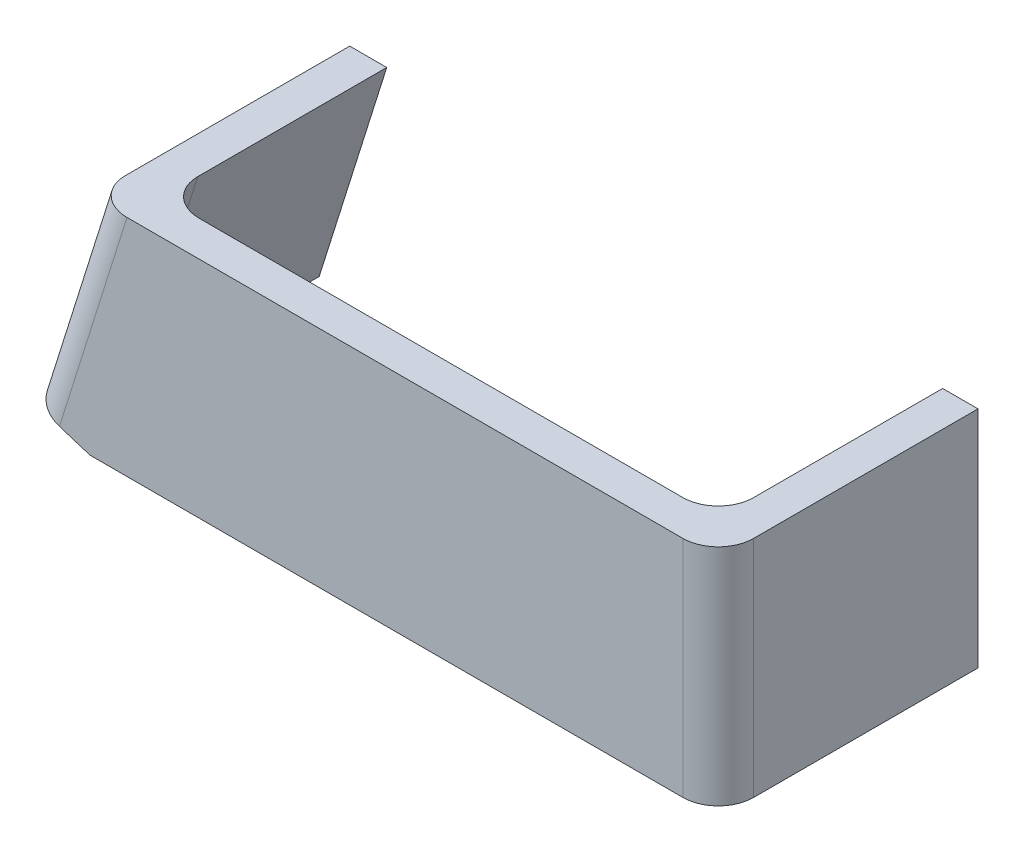
ISO-10303-21;
HEADER;
FILE_DESCRIPTION(('STEP AP214'),'2;1');
FILE_NAME('part.step','',(''),(''),'','','');
FILE_SCHEMA(('AUTOMOTIVE_DESIGN { 1 0 10303 214 1 1 1 1 }'));
ENDSEC;
DATA;
#1=APPLICATION_CONTEXT('core data for automotive mechanical design processes');
#2=APPLICATION_PROTOCOL_DEFINITION('international standard','automotive_design',2000,#1);
#3=PRODUCT_CONTEXT('',#1,'mechanical');
#4=PRODUCT('Part','Part','',(#3));
#5=PRODUCT_RELATED_PRODUCT_CATEGORY('part','',(#4));
#6=PRODUCT_DEFINITION_FORMATION('','',#4);
#7=PRODUCT_DEFINITION_CONTEXT('part definition',#1,'design');
#8=PRODUCT_DEFINITION('design','',#6,#7);
#9=PRODUCT_DEFINITION_SHAPE('','',#8);
#10=(LENGTH_UNIT() NAMED_UNIT(*) SI_UNIT(.MILLI.,.METRE.));
#11=(NAMED_UNIT(*) PLANE_ANGLE_UNIT() SI_UNIT($,.RADIAN.));
#12=(NAMED_UNIT(*) SI_UNIT($,.STERADIAN.) SOLID_ANGLE_UNIT());
#13=UNCERTAINTY_MEASURE_WITH_UNIT(LENGTH_MEASURE(1.E-05),#10,'distance_accuracy_value','');
#14=(GEOMETRIC_REPRESENTATION_CONTEXT(3) GLOBAL_UNCERTAINTY_ASSIGNED_CONTEXT((#13)) GLOBAL_UNIT_ASSIGNED_CONTEXT((#10,
#11,#12)) REPRESENTATION_CONTEXT('',''));
#15=CARTESIAN_POINT('',(0.,0.,0.));
#16=DIRECTION('',(0.,0.,1.));
#17=DIRECTION('',(1.,0.,0.));
#18=AXIS2_PLACEMENT_3D('',#15,#16,#17);
#19=CARTESIAN_POINT('',(0.,0.,0.));
#20=DIRECTION('',(0.,0.,1.));
#21=DIRECTION('',(1.,0.,0.));
#22=AXIS2_PLACEMENT_3D('',#19,#20,#21);
#23=PLANE('',#22);
#24=DIRECTION('',(1.,0.,0.));
#25=VECTOR('',#24,1.);
#26=CARTESIAN_POINT('',(-44.4329582329642,-15.8750000000004,0.));
#27=LINE('',#26,#25);
#28=CARTESIAN_POINT('',(-43.9350229355213,-15.8750000000004,0.));
#29=VERTEX_POINT('',#28);
#30=CARTESIAN_POINT('',(34.4670417670356,-15.875,0.));
#31=VERTEX_POINT('',#30);
#32=EDGE_CURVE('E188',#29,#31,#27,.T.);
#33=ORIENTED_EDGE('',*,*,#32,.F.);
#34=DIRECTION('',(-0.299999999999992,-0.953939201416948,0.));
#35=VECTOR('',#34,1.);
#36=CARTESIAN_POINT('',(-34.42183804227,14.3750000000001,0.));
#37=LINE('',#36,#35);
#38=CARTESIAN_POINT('',(-33.9501098657451,15.875,0.));
#39=VERTEX_POINT('',#38);
#40=EDGE_CURVE('E219',#29,#39,#37,.F.);
#41=ORIENTED_EDGE('',*,*,#40,.T.);
#42=DIRECTION('',(-1.,0.,0.));
#43=VECTOR('',#42,1.);
#44=CARTESIAN_POINT('',(-44.4329582329643,15.875,0.));
#45=LINE('',#44,#43);
#46=CARTESIAN_POINT('',(34.4670417670356,15.875,0.));
#47=VERTEX_POINT('',#46);
#48=EDGE_CURVE('E171',#47,#39,#45,.T.);
#49=ORIENTED_EDGE('',*,*,#48,.F.);
#50=DIRECTION('',(0.,1.,0.));
#51=VECTOR('',#50,1.);
#52=CARTESIAN_POINT('',(34.4670417670356,-15.875,0.));
#53=LINE('',#52,#51);
#54=EDGE_CURVE('E217',#47,#31,#53,.F.);
#55=ORIENTED_EDGE('',*,*,#54,.T.);
#56=EDGE_LOOP('',(#33,#41,#49,#55));
#57=FACE_BOUND('',#56,.T.);
#58=ADVANCED_FACE('F39',(#57),#23,.F.);
#59=CARTESIAN_POINT('',(44.4670417670357,15.875,5.));
#60=DIRECTION('',(-1.,0.,0.));
#61=DIRECTION('',(0.,-1.,0.));
#62=AXIS2_PLACEMENT_3D('',#59,#60,#61);
#63=PLANE('',#62);
#64=DIRECTION('',(0.,0.,-1.));
#65=VECTOR('',#64,1.);
#66=CARTESIAN_POINT('',(44.4670417670357,15.875,5.));
#67=LINE('',#66,#65);
#68=CARTESIAN_POINT('',(44.4670417670357,15.875,0.));
#69=VERTEX_POINT('',#68);
#70=CARTESIAN_POINT('',(44.4670417670357,15.875,-31.75));
#71=VERTEX_POINT('',#70);
#72=EDGE_CURVE('E134',#69,#71,#67,.T.);
#73=ORIENTED_EDGE('',*,*,#72,.F.);
#74=DIRECTION('',(0.,1.,0.));
#75=VECTOR('',#74,1.);
#76=CARTESIAN_POINT('',(44.4670417670356,-15.875,0.));
#77=LINE('',#76,#75);
#78=CARTESIAN_POINT('',(44.4670417670356,-15.875,0.));
#79=VERTEX_POINT('',#78);
#80=EDGE_CURVE('E62',#69,#79,#77,.F.);
#81=ORIENTED_EDGE('',*,*,#80,.T.);
#82=DIRECTION('',(0.,0.,-1.));
#83=VECTOR('',#82,1.);
#84=CARTESIAN_POINT('',(44.4670417670356,-15.875,5.));
#85=LINE('',#84,#83);
#86=CARTESIAN_POINT('',(44.4670417670356,-15.875,-31.75));
#87=VERTEX_POINT('',#86);
#88=EDGE_CURVE('E149',#79,#87,#85,.T.);
#89=ORIENTED_EDGE('',*,*,#88,.T.);
#90=DIRECTION('',(0.,-1.,0.));
#91=VECTOR('',#90,1.);
#92=CARTESIAN_POINT('',(44.4670417670356,-15.875,-31.75));
#93=LINE('',#92,#91);
#94=EDGE_CURVE('E147',#71,#87,#93,.T.);
#95=ORIENTED_EDGE('',*,*,#94,.F.);
#96=EDGE_LOOP('',(#73,#81,#89,#95));
#97=FACE_BOUND('',#96,.T.);
#98=ADVANCED_FACE('F148',(#97),#63,.F.);
#99=CARTESIAN_POINT('',(-44.4329582329643,15.875,5.));
#100=DIRECTION('',(0.,-1.,0.));
#101=DIRECTION('',(1.,0.,0.));
#102=AXIS2_PLACEMENT_3D('',#99,#100,#101);
#103=PLANE('',#102);
#104=DIRECTION('',(0.,0.,-1.));
#105=VECTOR('',#104,1.);
#106=CARTESIAN_POINT('',(-44.4329582329643,15.875,5.));
#107=LINE('',#106,#105);
#108=CARTESIAN_POINT('',(-44.4329582329643,15.875,0.));
#109=VERTEX_POINT('',#108);
#110=CARTESIAN_POINT('',(-44.4329582329643,15.875,-31.75));
#111=VERTEX_POINT('',#110);
#112=EDGE_CURVE('E144',#109,#111,#107,.T.);
#113=ORIENTED_EDGE('',*,*,#112,.F.);
#114=CARTESIAN_POINT('',(-39.1915340493547,15.875,0.));
#115=DIRECTION('',(0.,-1.,0.));
#116=DIRECTION('',(1.,0.,0.));
#117=AXIS2_PLACEMENT_3D('',#114,#115,#116);
#118=ELLIPSE('',#117,5.24142418360958,5.);
#119=CARTESIAN_POINT('',(-39.1915340493547,15.875,5.));
#120=VERTEX_POINT('',#119);
#121=EDGE_CURVE('E212',#109,#120,#118,.F.);
#122=ORIENTED_EDGE('',*,*,#121,.T.);
#123=DIRECTION('',(-1.,0.,0.));
#124=VECTOR('',#123,1.);
#125=CARTESIAN_POINT('',(-44.4329582329643,15.875,5.));
#126=LINE('',#125,#124);
#127=CARTESIAN_POINT('',(39.4670417670357,15.875,5.));
#128=VERTEX_POINT('',#127);
#129=EDGE_CURVE('E184',#128,#120,#126,.T.);
#130=ORIENTED_EDGE('',*,*,#129,.F.);
#131=CARTESIAN_POINT('',(39.4670417670357,15.875,0.));
#132=DIRECTION('',(0.,-1.,0.));
#133=DIRECTION('',(1.,0.,0.));
#134=AXIS2_PLACEMENT_3D('',#131,#132,#133);
#135=CIRCLE('',#134,5.);
#136=EDGE_CURVE('E142',#128,#69,#135,.F.);
#137=ORIENTED_EDGE('',*,*,#136,.T.);
#138=ORIENTED_EDGE('',*,*,#72,.T.);
#139=DIRECTION('',(1.,0.,0.));
#140=VECTOR('',#139,1.);
#141=CARTESIAN_POINT('',(44.4670417670357,15.875,-31.75));
#142=LINE('',#141,#140);
#143=CARTESIAN_POINT('',(39.4670417670356,15.875,-31.75));
#144=VERTEX_POINT('',#143);
#145=EDGE_CURVE('E140',#144,#71,#142,.T.);
#146=ORIENTED_EDGE('',*,*,#145,.F.);
#147=DIRECTION('',(0.,0.,1.));
#148=VECTOR('',#147,1.);
#149=CARTESIAN_POINT('',(39.4670417670356,15.875,-31.75));
#150=LINE('',#149,#148);
#151=CARTESIAN_POINT('',(39.4670417670356,15.875,-5.));
#152=VERTEX_POINT('',#151);
#153=EDGE_CURVE('E166',#144,#152,#150,.T.);
#154=ORIENTED_EDGE('',*,*,#153,.T.);
#155=CARTESIAN_POINT('',(34.4670417670356,15.875,-5.));
#156=DIRECTION('',(0.,-1.,0.));
#157=DIRECTION('',(1.,0.,0.));
#158=AXIS2_PLACEMENT_3D('',#155,#156,#157);
#159=CIRCLE('',#158,5.);
#160=EDGE_CURVE('E47',#152,#47,#159,.T.);
#161=ORIENTED_EDGE('',*,*,#160,.T.);
#162=ORIENTED_EDGE('',*,*,#48,.T.);
#163=CARTESIAN_POINT('',(-33.9501098657451,15.875,-5.));
#164=DIRECTION('',(0.,-1.,0.));
#165=DIRECTION('',(1.,0.,0.));
#166=AXIS2_PLACEMENT_3D('',#163,#164,#165);
#167=ELLIPSE('',#166,5.24142418360958,5.);
#168=CARTESIAN_POINT('',(-39.1915340493547,15.875,-5.));
#169=VERTEX_POINT('',#168);
#170=EDGE_CURVE('E231',#39,#169,#167,.T.);
#171=ORIENTED_EDGE('',*,*,#170,.T.);
#172=DIRECTION('',(0.,0.,1.));
#173=VECTOR('',#172,1.);
#174=CARTESIAN_POINT('',(-39.1915340493547,15.875,-31.75));
#175=LINE('',#174,#173);
#176=CARTESIAN_POINT('',(-39.1915340493547,15.875,-31.75));
#177=VERTEX_POINT('',#176);
#178=EDGE_CURVE('E172',#177,#169,#175,.T.);
#179=ORIENTED_EDGE('',*,*,#178,.F.);
#180=DIRECTION('',(1.,0.,0.));
#181=VECTOR('',#180,1.);
#182=CARTESIAN_POINT('',(-44.4329582329643,15.875,-31.75));
#183=LINE('',#182,#181);
#184=EDGE_CURVE('E180',#111,#177,#183,.T.);
#185=ORIENTED_EDGE('',*,*,#184,.F.);
#186=EDGE_LOOP('',(#113,#122,#130,#137,#138,#146,#154,#161,#162,#171,#179,#185));
#187=FACE_BOUND('',#186,.T.);
#188=ADVANCED_FACE('F137',(#187),#103,.F.);
#189=CARTESIAN_POINT('',(-44.4329582329643,15.875,5.));
#190=DIRECTION('',(0.953939201416948,-0.299999999999992,0.));
#191=DIRECTION('',(0.299999999999992,0.953939201416948,0.));
#192=AXIS2_PLACEMENT_3D('',#189,#190,#191);
#193=PLANE('',#192);
#194=DIRECTION('',(0.,0.,-1.));
#195=VECTOR('',#194,1.);
#196=CARTESIAN_POINT('',(-53.5192291264606,-13.0175000000005,5.));
#197=LINE('',#196,#195);
#198=CARTESIAN_POINT('',(-53.5192291264606,-13.0175000000005,0.));
#199=VERTEX_POINT('',#198);
#200=CARTESIAN_POINT('',(-53.5192291264606,-13.0175000000005,-31.75));
#201=VERTEX_POINT('',#200);
#202=EDGE_CURVE('E199',#199,#201,#197,.T.);
#203=ORIENTED_EDGE('',*,*,#202,.F.);
#204=DIRECTION('',(-0.299999999999992,-0.953939201416948,0.));
#205=VECTOR('',#204,1.);
#206=CARTESIAN_POINT('',(-44.4329582329643,15.875,0.));
#207=LINE('',#206,#205);
#208=EDGE_CURVE('E209',#199,#109,#207,.F.);
#209=ORIENTED_EDGE('',*,*,#208,.T.);
#210=ORIENTED_EDGE('',*,*,#112,.T.);
#211=DIRECTION('',(0.299999999999992,0.953939201416948,0.));
#212=VECTOR('',#211,1.);
#213=CARTESIAN_POINT('',(-53.5192291264606,-13.0175000000005,-31.75));
#214=LINE('',#213,#212);
#215=EDGE_CURVE('E161',#201,#111,#214,.T.);
#216=ORIENTED_EDGE('',*,*,#215,.F.);
#217=EDGE_LOOP('',(#203,#209,#210,#216));
#218=FACE_BOUND('',#217,.T.);
#219=ADVANCED_FACE('F275',(#218),#193,.F.);
#220=CARTESIAN_POINT('',(-44.4329582329642,-15.8750000000004,5.));
#221=DIRECTION('',(0.299999999999997,0.953939201416947,0.));
#222=DIRECTION('',(-0.953939201416947,0.299999999999997,0.));
#223=AXIS2_PLACEMENT_3D('',#220,#221,#222);
#224=PLANE('',#223);
#225=DIRECTION('',(0.953939201416947,-0.299999999999997,0.));
#226=VECTOR('',#225,1.);
#227=CARTESIAN_POINT('',(-44.4329582329642,-15.8750000000004,5.));
#228=LINE('',#227,#226);
#229=CARTESIAN_POINT('',(-48.7495331193758,-14.5175000000005,5.));
#230=VERTEX_POINT('',#229);
#231=CARTESIAN_POINT('',(-44.4329582329642,-15.8750000000004,5.));
#232=VERTEX_POINT('',#231);
#233=EDGE_CURVE('E187',#230,#232,#228,.T.);
#234=ORIENTED_EDGE('',*,*,#233,.F.);
#235=CARTESIAN_POINT('',(-48.7495331193759,-14.5175000000005,0.));
#236=DIRECTION('',(0.299999999999997,0.953939201416947,0.));
#237=DIRECTION('',(-0.953939201416947,0.299999999999997,0.));
#238=AXIS2_PLACEMENT_3D('',#235,#236,#237);
#239=CIRCLE('',#238,5.);
#240=EDGE_CURVE('E207',#230,#199,#239,.F.);
#241=ORIENTED_EDGE('',*,*,#240,.T.);
#242=ORIENTED_EDGE('',*,*,#202,.T.);
#243=DIRECTION('',(-0.953939201416947,0.299999999999997,0.));
#244=VECTOR('',#243,1.);
#245=CARTESIAN_POINT('',(-48.7495331193759,-14.5175000000005,-31.75));
#246=LINE('',#245,#244);
#247=CARTESIAN_POINT('',(-48.7495331193759,-14.5175000000005,-31.75));
#248=VERTEX_POINT('',#247);
#249=EDGE_CURVE('E158',#248,#201,#246,.T.);
#250=ORIENTED_EDGE('',*,*,#249,.F.);
#251=DIRECTION('',(0.,0.,1.));
#252=VECTOR('',#251,1.);
#253=CARTESIAN_POINT('',(-48.7495331193759,-14.5175000000005,-31.75));
#254=LINE('',#253,#252);
#255=CARTESIAN_POINT('',(-48.7495331193759,-14.5175000000005,-5.));
#256=VERTEX_POINT('',#255);
#257=EDGE_CURVE('E175',#248,#256,#254,.T.);
#258=ORIENTED_EDGE('',*,*,#257,.T.);
#259=CARTESIAN_POINT('',(-43.9798371122911,-16.0175000000004,-5.));
#260=DIRECTION('',(0.299999999999997,0.953939201416947,0.));
#261=DIRECTION('',(-0.953939201416947,0.299999999999997,0.));
#262=AXIS2_PLACEMENT_3D('',#259,#260,#261);
#263=CIRCLE('',#262,5.);
#264=CARTESIAN_POINT('',(-44.4329582329642,-15.8750000000004,-0.0226136376608264));
#265=VERTEX_POINT('',#264);
#266=EDGE_CURVE('E227',#256,#265,#263,.T.);
#267=ORIENTED_EDGE('',*,*,#266,.T.);
#268=DIRECTION('',(0.,0.,-1.));
#269=VECTOR('',#268,1.);
#270=CARTESIAN_POINT('',(-44.4329582329642,-15.8750000000004,5.));
#271=LINE('',#270,#269);
#272=EDGE_CURVE('E54',#232,#265,#271,.T.);
#273=ORIENTED_EDGE('',*,*,#272,.F.);
#274=EDGE_LOOP('',(#234,#241,#242,#250,#258,#267,#273));
#275=FACE_BOUND('',#274,.T.);
#276=ADVANCED_FACE('F272',(#275),#224,.F.);
#277=CARTESIAN_POINT('',(-44.4329582329642,-15.8750000000004,5.));
#278=DIRECTION('',(0.,1.,0.));
#279=DIRECTION('',(-1.,0.,0.));
#280=AXIS2_PLACEMENT_3D('',#277,#278,#279);
#281=PLANE('',#280);
#282=ORIENTED_EDGE('',*,*,#88,.F.);
#283=CARTESIAN_POINT('',(39.4670417670356,-15.875,0.));
#284=DIRECTION('',(0.,1.,0.));
#285=DIRECTION('',(-1.,0.,0.));
#286=AXIS2_PLACEMENT_3D('',#283,#284,#285);
#287=CIRCLE('',#286,5.);
#288=CARTESIAN_POINT('',(39.4670417670356,-15.875,5.));
#289=VERTEX_POINT('',#288);
#290=EDGE_CURVE('E225',#79,#289,#287,.F.);
#291=ORIENTED_EDGE('',*,*,#290,.T.);
#292=DIRECTION('',(1.,0.,0.));
#293=VECTOR('',#292,1.);
#294=CARTESIAN_POINT('',(-44.4329582329642,-15.8750000000004,5.));
#295=LINE('',#294,#293);
#296=EDGE_CURVE('E190',#232,#289,#295,.T.);
#297=ORIENTED_EDGE('',*,*,#296,.F.);
#298=ORIENTED_EDGE('',*,*,#272,.T.);
#299=CARTESIAN_POINT('',(-43.9350229355213,-15.8750000000004,-5.));
#300=DIRECTION('',(0.,1.,0.));
#301=DIRECTION('',(1.,0.,0.));
#302=AXIS2_PLACEMENT_3D('',#299,#300,#301);
#303=ELLIPSE('',#302,5.24142418360959,5.);
#304=EDGE_CURVE('E229',#265,#29,#303,.T.);
#305=ORIENTED_EDGE('',*,*,#304,.T.);
#306=ORIENTED_EDGE('',*,*,#32,.T.);
#307=CARTESIAN_POINT('',(34.4670417670356,-15.875,-5.));
#308=DIRECTION('',(0.,1.,0.));
#309=DIRECTION('',(-1.,0.,0.));
#310=AXIS2_PLACEMENT_3D('',#307,#308,#309);
#311=CIRCLE('',#310,5.);
#312=CARTESIAN_POINT('',(39.4670417670356,-15.8750000000004,-5.));
#313=VERTEX_POINT('',#312);
#314=EDGE_CURVE('E11',#31,#313,#311,.T.);
#315=ORIENTED_EDGE('',*,*,#314,.T.);
#316=DIRECTION('',(0.,0.,1.));
#317=VECTOR('',#316,1.);
#318=CARTESIAN_POINT('',(39.4670417670356,-15.8750000000004,-31.75));
#319=LINE('',#318,#317);
#320=CARTESIAN_POINT('',(39.4670417670356,-15.8750000000004,-31.75));
#321=VERTEX_POINT('',#320);
#322=EDGE_CURVE('E168',#321,#313,#319,.T.);
#323=ORIENTED_EDGE('',*,*,#322,.F.);
#324=DIRECTION('',(-1.,0.,0.));
#325=VECTOR('',#324,1.);
#326=CARTESIAN_POINT('',(39.4670417670356,-15.8750000000004,-31.75));
#327=LINE('',#326,#325);
#328=EDGE_CURVE('E152',#87,#321,#327,.T.);
#329=ORIENTED_EDGE('',*,*,#328,.F.);
#330=EDGE_LOOP('',(#282,#291,#297,#298,#305,#306,#315,#323,#329));
#331=FACE_BOUND('',#330,.T.);
#332=ADVANCED_FACE('F243',(#331),#281,.F.);
#333=CARTESIAN_POINT('',(0.,0.,5.));
#334=DIRECTION('',(0.,0.,1.));
#335=DIRECTION('',(1.,0.,0.));
#336=AXIS2_PLACEMENT_3D('',#333,#334,#335);
#337=PLANE('',#336);
#338=ORIENTED_EDGE('',*,*,#129,.T.);
#339=DIRECTION('',(-0.299999999999992,-0.953939201416948,0.));
#340=VECTOR('',#339,1.);
#341=CARTESIAN_POINT('',(-48.7495331193758,-14.5175000000004,5.));
#342=LINE('',#341,#340);
#343=EDGE_CURVE('E204',#120,#230,#342,.T.);
#344=ORIENTED_EDGE('',*,*,#343,.T.);
#345=ORIENTED_EDGE('',*,*,#233,.T.);
#346=ORIENTED_EDGE('',*,*,#296,.T.);
#347=DIRECTION('',(0.,1.,0.));
#348=VECTOR('',#347,1.);
#349=CARTESIAN_POINT('',(39.4670417670357,15.875,5.));
#350=LINE('',#349,#348);
#351=EDGE_CURVE('E143',#289,#128,#350,.T.);
#352=ORIENTED_EDGE('',*,*,#351,.T.);
#353=EDGE_LOOP('',(#338,#344,#345,#346,#352));
#354=FACE_BOUND('',#353,.T.);
#355=ADVANCED_FACE('F269',(#354),#337,.T.);
#356=CARTESIAN_POINT('',(-48.7495331193759,-14.5175000000005,-31.75));
#357=DIRECTION('',(-0.953939201416948,0.299999999999992,0.));
#358=DIRECTION('',(-0.299999999999992,-0.953939201416948,0.));
#359=AXIS2_PLACEMENT_3D('',#356,#357,#358);
#360=PLANE('',#359);
#361=ORIENTED_EDGE('',*,*,#178,.T.);
#362=DIRECTION('',(-0.299999999999992,-0.953939201416948,0.));
#363=VECTOR('',#362,1.);
#364=CARTESIAN_POINT('',(-48.7495331193759,-14.5175000000005,-5.));
#365=LINE('',#364,#363);
#366=EDGE_CURVE('E214',#169,#256,#365,.T.);
#367=ORIENTED_EDGE('',*,*,#366,.T.);
#368=ORIENTED_EDGE('',*,*,#257,.F.);
#369=DIRECTION('',(-0.299999999999992,-0.953939201416948,0.));
#370=VECTOR('',#369,1.);
#371=CARTESIAN_POINT('',(-48.7495331193759,-14.5175000000005,-31.75));
#372=LINE('',#371,#370);
#373=EDGE_CURVE('E178',#177,#248,#372,.T.);
#374=ORIENTED_EDGE('',*,*,#373,.F.);
#375=EDGE_LOOP('',(#361,#367,#368,#374));
#376=FACE_BOUND('',#375,.T.);
#377=ADVANCED_FACE('F257',(#376),#360,.F.);
#378=CARTESIAN_POINT('',(0.,0.,-31.75));
#379=DIRECTION('',(0.,0.,-1.));
#380=DIRECTION('',(-1.,0.,0.));
#381=AXIS2_PLACEMENT_3D('',#378,#379,#380);
#382=PLANE('',#381);
#383=ORIENTED_EDGE('',*,*,#249,.T.);
#384=ORIENTED_EDGE('',*,*,#215,.T.);
#385=ORIENTED_EDGE('',*,*,#184,.T.);
#386=ORIENTED_EDGE('',*,*,#373,.T.);
#387=EDGE_LOOP('',(#383,#384,#385,#386));
#388=FACE_BOUND('',#387,.T.);
#389=ADVANCED_FACE('F247',(#388),#382,.T.);
#390=CARTESIAN_POINT('',(39.4670417670356,15.875,-31.75));
#391=DIRECTION('',(1.,0.,0.));
#392=DIRECTION('',(0.,0.,-1.));
#393=AXIS2_PLACEMENT_3D('',#390,#391,#392);
#394=PLANE('',#393);
#395=ORIENTED_EDGE('',*,*,#322,.T.);
#396=DIRECTION('',(0.,1.,0.));
#397=VECTOR('',#396,1.);
#398=CARTESIAN_POINT('',(39.4670417670356,15.875,-5.));
#399=LINE('',#398,#397);
#400=EDGE_CURVE('E221',#313,#152,#399,.T.);
#401=ORIENTED_EDGE('',*,*,#400,.T.);
#402=ORIENTED_EDGE('',*,*,#153,.F.);
#403=DIRECTION('',(0.,1.,0.));
#404=VECTOR('',#403,1.);
#405=CARTESIAN_POINT('',(39.4670417670356,15.875,-31.75));
#406=LINE('',#405,#404);
#407=EDGE_CURVE('E156',#321,#144,#406,.T.);
#408=ORIENTED_EDGE('',*,*,#407,.F.);
#409=EDGE_LOOP('',(#395,#401,#402,#408));
#410=FACE_BOUND('',#409,.T.);
#411=ADVANCED_FACE('F245',(#410),#394,.F.);
#412=CARTESIAN_POINT('',(0.,0.,-31.75));
#413=DIRECTION('',(0.,0.,1.));
#414=DIRECTION('',(1.,0.,0.));
#415=AXIS2_PLACEMENT_3D('',#412,#413,#414);
#416=PLANE('',#415);
#417=ORIENTED_EDGE('',*,*,#145,.T.);
#418=ORIENTED_EDGE('',*,*,#94,.T.);
#419=ORIENTED_EDGE('',*,*,#328,.T.);
#420=ORIENTED_EDGE('',*,*,#407,.T.);
#421=EDGE_LOOP('',(#417,#418,#419,#420));
#422=FACE_BOUND('',#421,.T.);
#423=ADVANCED_FACE('F154',(#422),#416,.F.);
#424=CARTESIAN_POINT('',(-40.2074314316611,12.6446522080036,0.));
#425=DIRECTION('',(0.299999999999992,0.953939201416948,0.));
#426=DIRECTION('',(-0.953939201416948,0.299999999999992,0.));
#427=AXIS2_PLACEMENT_3D('',#424,#425,#426);
#428=CYLINDRICAL_SURFACE('',#427,5.);
#429=ORIENTED_EDGE('',*,*,#121,.F.);
#430=ORIENTED_EDGE('',*,*,#208,.F.);
#431=ORIENTED_EDGE('',*,*,#240,.F.);
#432=ORIENTED_EDGE('',*,*,#343,.F.);
#433=EDGE_LOOP('',(#429,#430,#431,#432));
#434=FACE_BOUND('',#433,.T.);
#435=ADVANCED_FACE('F254',(#434),#428,.T.);
#436=CARTESIAN_POINT('',(-43.9798371122911,-16.0175000000004,-5.));
#437=DIRECTION('',(0.299999999999992,0.953939201416948,0.));
#438=DIRECTION('',(-0.953939201416948,0.299999999999992,0.));
#439=AXIS2_PLACEMENT_3D('',#436,#437,#438);
#440=CYLINDRICAL_SURFACE('',#439,5.);
#441=ORIENTED_EDGE('',*,*,#170,.F.);
#442=ORIENTED_EDGE('',*,*,#40,.F.);
#443=ORIENTED_EDGE('',*,*,#304,.F.);
#444=ORIENTED_EDGE('',*,*,#266,.F.);
#445=ORIENTED_EDGE('',*,*,#366,.F.);
#446=EDGE_LOOP('',(#441,#442,#443,#444,#445));
#447=FACE_BOUND('',#446,.T.);
#448=ADVANCED_FACE('F283',(#447),#440,.F.);
#449=CARTESIAN_POINT('',(34.4670417670356,15.875,-5.));
#450=DIRECTION('',(0.,-1.,0.));
#451=DIRECTION('',(0.,0.,-1.));
#452=AXIS2_PLACEMENT_3D('',#449,#450,#451);
#453=CYLINDRICAL_SURFACE('',#452,5.);
#454=ORIENTED_EDGE('',*,*,#314,.F.);
#455=ORIENTED_EDGE('',*,*,#54,.F.);
#456=ORIENTED_EDGE('',*,*,#160,.F.);
#457=ORIENTED_EDGE('',*,*,#400,.F.);
#458=EDGE_LOOP('',(#454,#455,#456,#457));
#459=FACE_BOUND('',#458,.T.);
#460=ADVANCED_FACE('F241',(#459),#453,.F.);
#461=CARTESIAN_POINT('',(39.4670417670357,-1.20756113931197E-13,0.));
#462=DIRECTION('',(0.,-1.,0.));
#463=DIRECTION('',(1.,0.,0.));
#464=AXIS2_PLACEMENT_3D('',#461,#462,#463);
#465=CYLINDRICAL_SURFACE('',#464,5.);
#466=ORIENTED_EDGE('',*,*,#290,.F.);
#467=ORIENTED_EDGE('',*,*,#80,.F.);
#468=ORIENTED_EDGE('',*,*,#136,.F.);
#469=ORIENTED_EDGE('',*,*,#351,.F.);
#470=EDGE_LOOP('',(#466,#467,#468,#469));
#471=FACE_BOUND('',#470,.T.);
#472=ADVANCED_FACE('F41',(#471),#465,.T.);
#473=CLOSED_SHELL('',(#58,#98,#188,#219,#276,#332,#355,#377,#389,#411,#423,#435,#448,#460,#472));
#474=MANIFOLD_SOLID_BREP('B2',#473);
#475=ADVANCED_BREP_SHAPE_REPRESENTATION('',(#18,#474),#14);
#476=SHAPE_DEFINITION_REPRESENTATION(#9,#475);
ENDSEC;
END-ISO-10303-21;
